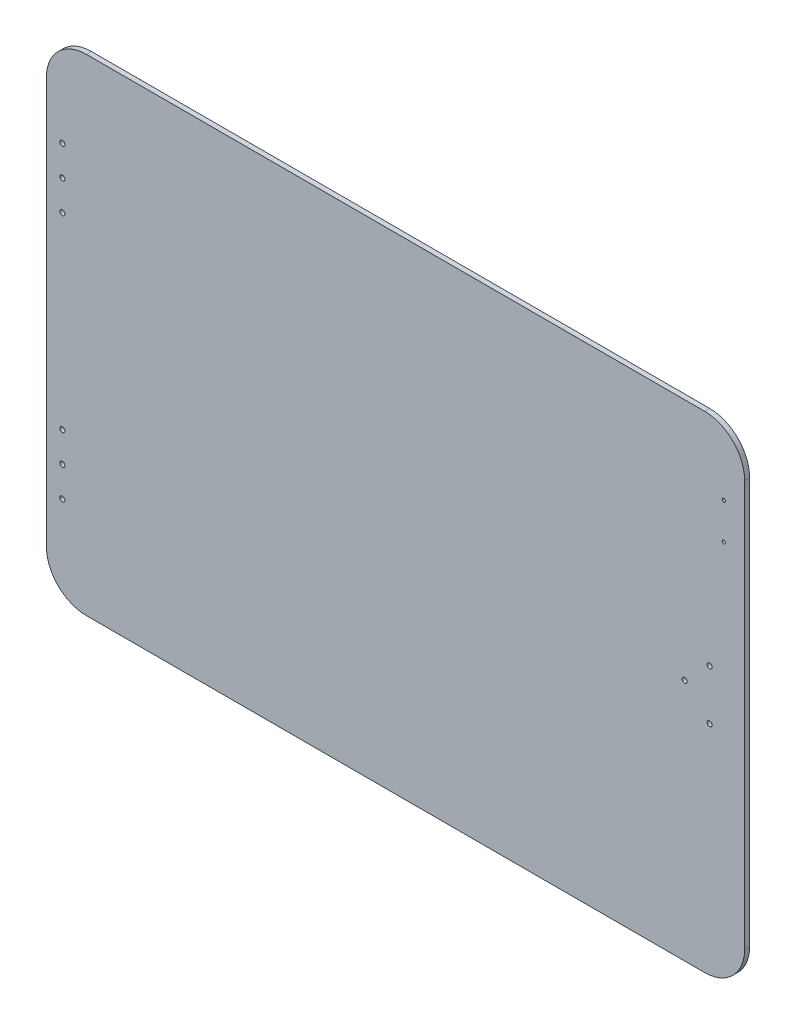
ISO-10303-21;
HEADER;
FILE_DESCRIPTION(('STEP AP214'),'2;1');
FILE_NAME('part.step','',(''),(''),'','','');
FILE_SCHEMA(('AUTOMOTIVE_DESIGN { 1 0 10303 214 1 1 1 1 }'));
ENDSEC;
DATA;
#1=APPLICATION_CONTEXT('core data for automotive mechanical design processes');
#2=APPLICATION_PROTOCOL_DEFINITION('international standard','automotive_design',2000,#1);
#3=PRODUCT_CONTEXT('',#1,'mechanical');
#4=PRODUCT('Part','Part','',(#3));
#5=PRODUCT_RELATED_PRODUCT_CATEGORY('part','',(#4));
#6=PRODUCT_DEFINITION_FORMATION('','',#4);
#7=PRODUCT_DEFINITION_CONTEXT('part definition',#1,'design');
#8=PRODUCT_DEFINITION('design','',#6,#7);
#9=PRODUCT_DEFINITION_SHAPE('','',#8);
#10=(LENGTH_UNIT() NAMED_UNIT(*) SI_UNIT(.MILLI.,.METRE.));
#11=(NAMED_UNIT(*) PLANE_ANGLE_UNIT() SI_UNIT($,.RADIAN.));
#12=(NAMED_UNIT(*) SI_UNIT($,.STERADIAN.) SOLID_ANGLE_UNIT());
#13=UNCERTAINTY_MEASURE_WITH_UNIT(LENGTH_MEASURE(1.E-05),#10,'distance_accuracy_value','');
#14=(GEOMETRIC_REPRESENTATION_CONTEXT(3) GLOBAL_UNCERTAINTY_ASSIGNED_CONTEXT((#13)) GLOBAL_UNIT_ASSIGNED_CONTEXT((#10,
#11,#12)) REPRESENTATION_CONTEXT('',''));
#15=CARTESIAN_POINT('',(0.,0.,0.));
#16=DIRECTION('',(0.,0.,1.));
#17=DIRECTION('',(1.,0.,0.));
#18=AXIS2_PLACEMENT_3D('',#15,#16,#17);
#19=CARTESIAN_POINT('',(-349.,-242.95,5.));
#20=DIRECTION('',(1.,0.,0.));
#21=DIRECTION('',(0.,0.,-1.));
#22=AXIS2_PLACEMENT_3D('',#19,#20,#21);
#23=PLANE('',#22);
#24=DIRECTION('',(0.,-1.,0.));
#25=VECTOR('',#24,1.);
#26=CARTESIAN_POINT('',(-349.,-242.95,5.));
#27=LINE('',#26,#25);
#28=CARTESIAN_POINT('',(-349.,202.95,5.));
#29=VERTEX_POINT('',#28);
#30=CARTESIAN_POINT('',(-349.,-202.95,5.));
#31=VERTEX_POINT('',#30);
#32=EDGE_CURVE('E129',#29,#31,#27,.T.);
#33=ORIENTED_EDGE('',*,*,#32,.F.);
#34=DIRECTION('',(0.,0.,-1.));
#35=VECTOR('',#34,1.);
#36=CARTESIAN_POINT('',(-349.,202.95,5.));
#37=LINE('',#36,#35);
#38=CARTESIAN_POINT('',(-349.,202.95,0.));
#39=VERTEX_POINT('',#38);
#40=EDGE_CURVE('E113',#29,#39,#37,.T.);
#41=ORIENTED_EDGE('',*,*,#40,.T.);
#42=DIRECTION('',(0.,-1.,0.));
#43=VECTOR('',#42,1.);
#44=CARTESIAN_POINT('',(-349.,-242.95,0.));
#45=LINE('',#44,#43);
#46=CARTESIAN_POINT('',(-349.,-202.95,0.));
#47=VERTEX_POINT('',#46);
#48=EDGE_CURVE('E126',#39,#47,#45,.T.);
#49=ORIENTED_EDGE('',*,*,#48,.T.);
#50=DIRECTION('',(0.,0.,-1.));
#51=VECTOR('',#50,1.);
#52=CARTESIAN_POINT('',(-349.,-202.95,5.));
#53=LINE('',#52,#51);
#54=EDGE_CURVE('E132',#47,#31,#53,.F.);
#55=ORIENTED_EDGE('',*,*,#54,.T.);
#56=EDGE_LOOP('',(#33,#41,#49,#55));
#57=FACE_BOUND('',#56,.T.);
#58=ADVANCED_FACE('F42',(#57),#23,.F.);
#59=CARTESIAN_POINT('',(349.,-242.95,5.));
#60=DIRECTION('',(0.,1.,0.));
#61=DIRECTION('',(0.,0.,1.));
#62=AXIS2_PLACEMENT_3D('',#59,#60,#61);
#63=PLANE('',#62);
#64=DIRECTION('',(1.,0.,0.));
#65=VECTOR('',#64,1.);
#66=CARTESIAN_POINT('',(349.,-242.95,5.));
#67=LINE('',#66,#65);
#68=CARTESIAN_POINT('',(-309.000000000001,-242.95,5.));
#69=VERTEX_POINT('',#68);
#70=CARTESIAN_POINT('',(309.,-242.95,5.));
#71=VERTEX_POINT('',#70);
#72=EDGE_CURVE('E267',#69,#71,#67,.T.);
#73=ORIENTED_EDGE('',*,*,#72,.F.);
#74=DIRECTION('',(0.,0.,-1.));
#75=VECTOR('',#74,1.);
#76=CARTESIAN_POINT('',(-309.000000000001,-242.95,5.));
#77=LINE('',#76,#75);
#78=CARTESIAN_POINT('',(-309.000000000001,-242.95,0.));
#79=VERTEX_POINT('',#78);
#80=EDGE_CURVE('E186',#69,#79,#77,.T.);
#81=ORIENTED_EDGE('',*,*,#80,.T.);
#82=DIRECTION('',(1.,0.,0.));
#83=VECTOR('',#82,1.);
#84=CARTESIAN_POINT('',(349.,-242.95,0.));
#85=LINE('',#84,#83);
#86=CARTESIAN_POINT('',(309.,-242.95,0.));
#87=VERTEX_POINT('',#86);
#88=EDGE_CURVE('E137',#79,#87,#85,.T.);
#89=ORIENTED_EDGE('',*,*,#88,.T.);
#90=DIRECTION('',(0.,0.,-1.));
#91=VECTOR('',#90,1.);
#92=CARTESIAN_POINT('',(309.,-242.95,5.));
#93=LINE('',#92,#91);
#94=EDGE_CURVE('E183',#87,#71,#93,.F.);
#95=ORIENTED_EDGE('',*,*,#94,.T.);
#96=EDGE_LOOP('',(#73,#81,#89,#95));
#97=FACE_BOUND('',#96,.T.);
#98=ADVANCED_FACE('F285',(#97),#63,.F.);
#99=CARTESIAN_POINT('',(349.,-242.95,5.));
#100=DIRECTION('',(-1.,0.,0.));
#101=DIRECTION('',(0.,0.,1.));
#102=AXIS2_PLACEMENT_3D('',#99,#100,#101);
#103=PLANE('',#102);
#104=DIRECTION('',(0.,1.,0.));
#105=VECTOR('',#104,1.);
#106=CARTESIAN_POINT('',(349.,-242.95,5.));
#107=LINE('',#106,#105);
#108=CARTESIAN_POINT('',(349.,-202.95,5.));
#109=VERTEX_POINT('',#108);
#110=CARTESIAN_POINT('',(349.,202.95,5.));
#111=VERTEX_POINT('',#110);
#112=EDGE_CURVE('E219',#109,#111,#107,.T.);
#113=ORIENTED_EDGE('',*,*,#112,.F.);
#114=DIRECTION('',(0.,0.,-1.));
#115=VECTOR('',#114,1.);
#116=CARTESIAN_POINT('',(349.,-202.95,5.));
#117=LINE('',#116,#115);
#118=CARTESIAN_POINT('',(349.,-202.95,0.));
#119=VERTEX_POINT('',#118);
#120=EDGE_CURVE('E11',#109,#119,#117,.T.);
#121=ORIENTED_EDGE('',*,*,#120,.T.);
#122=DIRECTION('',(0.,1.,0.));
#123=VECTOR('',#122,1.);
#124=CARTESIAN_POINT('',(349.,-242.95,0.));
#125=LINE('',#124,#123);
#126=CARTESIAN_POINT('',(349.,202.95,0.));
#127=VERTEX_POINT('',#126);
#128=EDGE_CURVE('E144',#119,#127,#125,.T.);
#129=ORIENTED_EDGE('',*,*,#128,.T.);
#130=DIRECTION('',(0.,0.,-1.));
#131=VECTOR('',#130,1.);
#132=CARTESIAN_POINT('',(349.,202.95,5.));
#133=LINE('',#132,#131);
#134=EDGE_CURVE('E51',#127,#111,#133,.F.);
#135=ORIENTED_EDGE('',*,*,#134,.T.);
#136=EDGE_LOOP('',(#113,#121,#129,#135));
#137=FACE_BOUND('',#136,.T.);
#138=ADVANCED_FACE('F279',(#137),#103,.F.);
#139=CARTESIAN_POINT('',(349.,242.95,5.));
#140=DIRECTION('',(0.,-1.,0.));
#141=DIRECTION('',(0.,0.,-1.));
#142=AXIS2_PLACEMENT_3D('',#139,#140,#141);
#143=PLANE('',#142);
#144=DIRECTION('',(-1.,0.,0.));
#145=VECTOR('',#144,1.);
#146=CARTESIAN_POINT('',(349.,242.95,0.));
#147=LINE('',#146,#145);
#148=CARTESIAN_POINT('',(309.,242.95,0.));
#149=VERTEX_POINT('',#148);
#150=CARTESIAN_POINT('',(-309.000000000001,242.95,0.));
#151=VERTEX_POINT('',#150);
#152=EDGE_CURVE('E155',#149,#151,#147,.T.);
#153=ORIENTED_EDGE('',*,*,#152,.T.);
#154=DIRECTION('',(0.,0.,-1.));
#155=VECTOR('',#154,1.);
#156=CARTESIAN_POINT('',(-309.000000000001,242.95,5.));
#157=LINE('',#156,#155);
#158=CARTESIAN_POINT('',(-309.000000000001,242.95,5.));
#159=VERTEX_POINT('',#158);
#160=EDGE_CURVE('E114',#151,#159,#157,.F.);
#161=ORIENTED_EDGE('',*,*,#160,.T.);
#162=DIRECTION('',(-1.,0.,0.));
#163=VECTOR('',#162,1.);
#164=CARTESIAN_POINT('',(349.,242.95,5.));
#165=LINE('',#164,#163);
#166=CARTESIAN_POINT('',(309.,242.95,5.));
#167=VERTEX_POINT('',#166);
#168=EDGE_CURVE('E151',#167,#159,#165,.T.);
#169=ORIENTED_EDGE('',*,*,#168,.F.);
#170=DIRECTION('',(0.,0.,-1.));
#171=VECTOR('',#170,1.);
#172=CARTESIAN_POINT('',(309.,242.95,5.));
#173=LINE('',#172,#171);
#174=EDGE_CURVE('E120',#167,#149,#173,.T.);
#175=ORIENTED_EDGE('',*,*,#174,.T.);
#176=EDGE_LOOP('',(#153,#161,#169,#175));
#177=FACE_BOUND('',#176,.T.);
#178=ADVANCED_FACE('F277',(#177),#143,.F.);
#179=CARTESIAN_POINT('',(0.,0.,5.));
#180=DIRECTION('',(0.,0.,1.));
#181=DIRECTION('',(1.,0.,0.));
#182=AXIS2_PLACEMENT_3D('',#179,#180,#181);
#183=PLANE('',#182);
#184=CARTESIAN_POINT('',(328.180642757211,175.458967427581,5.));
#185=DIRECTION('',(0.,0.,1.));
#186=DIRECTION('',(1.,0.,0.));
#187=AXIS2_PLACEMENT_3D('',#184,#185,#186);
#188=CIRCLE('',#187,1.64999999999998);
#189=CARTESIAN_POINT('',(329.830642757211,175.458967427581,5.));
#190=VERTEX_POINT('',#189);
#191=EDGE_CURVE('E197',#190,#190,#188,.T.);
#192=ORIENTED_EDGE('',*,*,#191,.F.);
#193=EDGE_LOOP('',(#192));
#194=FACE_BOUND('',#193,.T.);
#195=CARTESIAN_POINT('',(328.180642757211,139.458967427581,5.));
#196=DIRECTION('',(0.,0.,1.));
#197=DIRECTION('',(1.,0.,0.));
#198=AXIS2_PLACEMENT_3D('',#195,#196,#197);
#199=CIRCLE('',#198,1.64999999999998);
#200=CARTESIAN_POINT('',(329.830642757211,139.458967427581,5.));
#201=VERTEX_POINT('',#200);
#202=EDGE_CURVE('E367',#201,#201,#199,.T.);
#203=ORIENTED_EDGE('',*,*,#202,.F.);
#204=EDGE_LOOP('',(#203));
#205=FACE_BOUND('',#204,.T.);
#206=CARTESIAN_POINT('',(-333.,-153.95,5.));
#207=DIRECTION('',(0.,0.,1.));
#208=DIRECTION('',(1.,0.,0.));
#209=AXIS2_PLACEMENT_3D('',#206,#207,#208);
#210=CIRCLE('',#209,2.5);
#211=CARTESIAN_POINT('',(-330.5,-153.95,5.));
#212=VERTEX_POINT('',#211);
#213=EDGE_CURVE('E237',#212,#212,#210,.T.);
#214=ORIENTED_EDGE('',*,*,#213,.F.);
#215=EDGE_LOOP('',(#214));
#216=FACE_BOUND('',#215,.T.);
#217=CARTESIAN_POINT('',(-333.,-123.95,5.));
#218=DIRECTION('',(0.,0.,1.));
#219=DIRECTION('',(1.,0.,0.));
#220=AXIS2_PLACEMENT_3D('',#217,#218,#219);
#221=CIRCLE('',#220,2.5);
#222=CARTESIAN_POINT('',(-330.5,-123.95,5.));
#223=VERTEX_POINT('',#222);
#224=EDGE_CURVE('E225',#223,#223,#221,.T.);
#225=ORIENTED_EDGE('',*,*,#224,.F.);
#226=EDGE_LOOP('',(#225));
#227=FACE_BOUND('',#226,.T.);
#228=CARTESIAN_POINT('',(-333.,-93.9499999999999,5.));
#229=DIRECTION('',(0.,0.,1.));
#230=DIRECTION('',(1.,0.,0.));
#231=AXIS2_PLACEMENT_3D('',#228,#229,#230);
#232=CIRCLE('',#231,2.5);
#233=CARTESIAN_POINT('',(-330.5,-93.9499999999999,5.));
#234=VERTEX_POINT('',#233);
#235=EDGE_CURVE('E205',#234,#234,#232,.T.);
#236=ORIENTED_EDGE('',*,*,#235,.F.);
#237=EDGE_LOOP('',(#236));
#238=FACE_BOUND('',#237,.T.);
#239=CARTESIAN_POINT('',(314.000000000001,25.,5.));
#240=DIRECTION('',(0.,0.,1.));
#241=DIRECTION('',(1.,0.,0.));
#242=AXIS2_PLACEMENT_3D('',#239,#240,#241);
#243=CIRCLE('',#242,2.5);
#244=CARTESIAN_POINT('',(316.500000000001,25.,5.));
#245=VERTEX_POINT('',#244);
#246=EDGE_CURVE('E204',#245,#245,#243,.T.);
#247=ORIENTED_EDGE('',*,*,#246,.F.);
#248=EDGE_LOOP('',(#247));
#249=FACE_BOUND('',#248,.T.);
#250=CARTESIAN_POINT('',(289.,0.,5.));
#251=DIRECTION('',(0.,0.,1.));
#252=DIRECTION('',(1.,0.,0.));
#253=AXIS2_PLACEMENT_3D('',#250,#251,#252);
#254=CIRCLE('',#253,2.5);
#255=CARTESIAN_POINT('',(291.5,0.,5.));
#256=VERTEX_POINT('',#255);
#257=EDGE_CURVE('E195',#256,#256,#254,.T.);
#258=ORIENTED_EDGE('',*,*,#257,.F.);
#259=EDGE_LOOP('',(#258));
#260=FACE_BOUND('',#259,.T.);
#261=CARTESIAN_POINT('',(314.,-25.,5.));
#262=DIRECTION('',(0.,0.,1.));
#263=DIRECTION('',(1.,0.,0.));
#264=AXIS2_PLACEMENT_3D('',#261,#262,#263);
#265=CIRCLE('',#264,2.5);
#266=CARTESIAN_POINT('',(316.5,-25.,5.));
#267=VERTEX_POINT('',#266);
#268=EDGE_CURVE('E194',#267,#267,#265,.T.);
#269=ORIENTED_EDGE('',*,*,#268,.F.);
#270=EDGE_LOOP('',(#269));
#271=FACE_BOUND('',#270,.T.);
#272=CARTESIAN_POINT('',(-333.,153.95,5.));
#273=DIRECTION('',(0.,0.,1.));
#274=DIRECTION('',(1.,0.,0.));
#275=AXIS2_PLACEMENT_3D('',#272,#273,#274);
#276=CIRCLE('',#275,2.5);
#277=CARTESIAN_POINT('',(-330.5,153.95,5.));
#278=VERTEX_POINT('',#277);
#279=EDGE_CURVE('E216',#278,#278,#276,.T.);
#280=ORIENTED_EDGE('',*,*,#279,.F.);
#281=EDGE_LOOP('',(#280));
#282=FACE_BOUND('',#281,.T.);
#283=CARTESIAN_POINT('',(-333.,123.95,5.));
#284=DIRECTION('',(0.,0.,1.));
#285=DIRECTION('',(1.,0.,0.));
#286=AXIS2_PLACEMENT_3D('',#283,#284,#285);
#287=CIRCLE('',#286,2.5);
#288=CARTESIAN_POINT('',(-330.5,123.95,5.));
#289=VERTEX_POINT('',#288);
#290=EDGE_CURVE('E215',#289,#289,#287,.T.);
#291=ORIENTED_EDGE('',*,*,#290,.F.);
#292=EDGE_LOOP('',(#291));
#293=FACE_BOUND('',#292,.T.);
#294=CARTESIAN_POINT('',(-333.,93.95,5.));
#295=DIRECTION('',(0.,0.,1.));
#296=DIRECTION('',(1.,0.,0.));
#297=AXIS2_PLACEMENT_3D('',#294,#295,#296);
#298=CIRCLE('',#297,2.5);
#299=CARTESIAN_POINT('',(-330.5,93.95,5.));
#300=VERTEX_POINT('',#299);
#301=EDGE_CURVE('E148',#300,#300,#298,.T.);
#302=ORIENTED_EDGE('',*,*,#301,.F.);
#303=EDGE_LOOP('',(#302));
#304=FACE_BOUND('',#303,.T.);
#305=ORIENTED_EDGE('',*,*,#168,.T.);
#306=CARTESIAN_POINT('',(-309.000000000001,202.95,5.));
#307=DIRECTION('',(0.,0.,1.));
#308=DIRECTION('',(1.,0.,0.));
#309=AXIS2_PLACEMENT_3D('',#306,#307,#308);
#310=CIRCLE('',#309,40.);
#311=EDGE_CURVE('E180',#159,#29,#310,.T.);
#312=ORIENTED_EDGE('',*,*,#311,.T.);
#313=ORIENTED_EDGE('',*,*,#32,.T.);
#314=CARTESIAN_POINT('',(-309.000000000001,-202.95,5.));
#315=DIRECTION('',(0.,0.,1.));
#316=DIRECTION('',(1.,0.,0.));
#317=AXIS2_PLACEMENT_3D('',#314,#315,#316);
#318=CIRCLE('',#317,40.);
#319=EDGE_CURVE('E177',#31,#69,#318,.T.);
#320=ORIENTED_EDGE('',*,*,#319,.T.);
#321=ORIENTED_EDGE('',*,*,#72,.T.);
#322=CARTESIAN_POINT('',(309.,-202.95,5.));
#323=DIRECTION('',(0.,0.,1.));
#324=DIRECTION('',(1.,0.,0.));
#325=AXIS2_PLACEMENT_3D('',#322,#323,#324);
#326=CIRCLE('',#325,40.);
#327=EDGE_CURVE('E64',#71,#109,#326,.T.);
#328=ORIENTED_EDGE('',*,*,#327,.T.);
#329=ORIENTED_EDGE('',*,*,#112,.T.);
#330=CARTESIAN_POINT('',(309.,202.95,5.));
#331=DIRECTION('',(0.,0.,1.));
#332=DIRECTION('',(1.,0.,0.));
#333=AXIS2_PLACEMENT_3D('',#330,#331,#332);
#334=CIRCLE('',#333,40.);
#335=EDGE_CURVE('E172',#111,#167,#334,.T.);
#336=ORIENTED_EDGE('',*,*,#335,.T.);
#337=EDGE_LOOP('',(#305,#312,#313,#320,#321,#328,#329,#336));
#338=FACE_BOUND('',#337,.T.);
#339=ADVANCED_FACE('F271',(#194,#205,#216,#227,#238,#249,#260,#271,#282,#293,#304,#338),#183,.T.);
#340=CARTESIAN_POINT('',(0.,0.,0.));
#341=DIRECTION('',(0.,0.,1.));
#342=DIRECTION('',(1.,0.,0.));
#343=AXIS2_PLACEMENT_3D('',#340,#341,#342);
#344=PLANE('',#343);
#345=CARTESIAN_POINT('',(328.180642757211,175.458967427581,0.));
#346=DIRECTION('',(0.,0.,1.));
#347=DIRECTION('',(1.,0.,0.));
#348=AXIS2_PLACEMENT_3D('',#345,#346,#347);
#349=CIRCLE('',#348,1.64999999999998);
#350=CARTESIAN_POINT('',(329.830642757211,175.458967427581,0.));
#351=VERTEX_POINT('',#350);
#352=EDGE_CURVE('E200',#351,#351,#349,.T.);
#353=ORIENTED_EDGE('',*,*,#352,.T.);
#354=EDGE_LOOP('',(#353));
#355=FACE_BOUND('',#354,.T.);
#356=CARTESIAN_POINT('',(328.180642757211,139.458967427581,0.));
#357=DIRECTION('',(0.,0.,1.));
#358=DIRECTION('',(1.,0.,0.));
#359=AXIS2_PLACEMENT_3D('',#356,#357,#358);
#360=CIRCLE('',#359,1.64999999999998);
#361=CARTESIAN_POINT('',(329.830642757211,139.458967427581,0.));
#362=VERTEX_POINT('',#361);
#363=EDGE_CURVE('E394',#362,#362,#360,.T.);
#364=ORIENTED_EDGE('',*,*,#363,.T.);
#365=EDGE_LOOP('',(#364));
#366=FACE_BOUND('',#365,.T.);
#367=CARTESIAN_POINT('',(-333.,-153.95,0.));
#368=DIRECTION('',(0.,0.,1.));
#369=DIRECTION('',(1.,0.,0.));
#370=AXIS2_PLACEMENT_3D('',#367,#368,#369);
#371=CIRCLE('',#370,2.5);
#372=CARTESIAN_POINT('',(-330.5,-153.95,0.));
#373=VERTEX_POINT('',#372);
#374=EDGE_CURVE('E228',#373,#373,#371,.T.);
#375=ORIENTED_EDGE('',*,*,#374,.T.);
#376=EDGE_LOOP('',(#375));
#377=FACE_BOUND('',#376,.T.);
#378=CARTESIAN_POINT('',(-333.,-123.95,0.));
#379=DIRECTION('',(0.,0.,1.));
#380=DIRECTION('',(1.,0.,0.));
#381=AXIS2_PLACEMENT_3D('',#378,#379,#380);
#382=CIRCLE('',#381,2.5);
#383=CARTESIAN_POINT('',(-330.5,-123.95,0.));
#384=VERTEX_POINT('',#383);
#385=EDGE_CURVE('E227',#384,#384,#382,.T.);
#386=ORIENTED_EDGE('',*,*,#385,.T.);
#387=EDGE_LOOP('',(#386));
#388=FACE_BOUND('',#387,.T.);
#389=CARTESIAN_POINT('',(-333.,-93.9499999999999,0.));
#390=DIRECTION('',(0.,0.,1.));
#391=DIRECTION('',(1.,0.,0.));
#392=AXIS2_PLACEMENT_3D('',#389,#390,#391);
#393=CIRCLE('',#392,2.5);
#394=CARTESIAN_POINT('',(-330.5,-93.9499999999999,0.));
#395=VERTEX_POINT('',#394);
#396=EDGE_CURVE('E202',#395,#395,#393,.T.);
#397=ORIENTED_EDGE('',*,*,#396,.T.);
#398=EDGE_LOOP('',(#397));
#399=FACE_BOUND('',#398,.T.);
#400=CARTESIAN_POINT('',(314.000000000001,25.,0.));
#401=DIRECTION('',(0.,0.,1.));
#402=DIRECTION('',(1.,0.,0.));
#403=AXIS2_PLACEMENT_3D('',#400,#401,#402);
#404=CIRCLE('',#403,2.5);
#405=CARTESIAN_POINT('',(316.500000000001,25.,0.));
#406=VERTEX_POINT('',#405);
#407=EDGE_CURVE('E247',#406,#406,#404,.T.);
#408=ORIENTED_EDGE('',*,*,#407,.T.);
#409=EDGE_LOOP('',(#408));
#410=FACE_BOUND('',#409,.T.);
#411=CARTESIAN_POINT('',(289.,0.,0.));
#412=DIRECTION('',(0.,0.,1.));
#413=DIRECTION('',(1.,0.,0.));
#414=AXIS2_PLACEMENT_3D('',#411,#412,#413);
#415=CIRCLE('',#414,2.5);
#416=CARTESIAN_POINT('',(291.5,0.,0.));
#417=VERTEX_POINT('',#416);
#418=EDGE_CURVE('E191',#417,#417,#415,.T.);
#419=ORIENTED_EDGE('',*,*,#418,.T.);
#420=EDGE_LOOP('',(#419));
#421=FACE_BOUND('',#420,.T.);
#422=CARTESIAN_POINT('',(314.,-25.,0.));
#423=DIRECTION('',(0.,0.,1.));
#424=DIRECTION('',(1.,0.,0.));
#425=AXIS2_PLACEMENT_3D('',#422,#423,#424);
#426=CIRCLE('',#425,2.5);
#427=CARTESIAN_POINT('',(316.5,-25.,0.));
#428=VERTEX_POINT('',#427);
#429=EDGE_CURVE('E222',#428,#428,#426,.T.);
#430=ORIENTED_EDGE('',*,*,#429,.T.);
#431=EDGE_LOOP('',(#430));
#432=FACE_BOUND('',#431,.T.);
#433=CARTESIAN_POINT('',(-333.,153.95,0.));
#434=DIRECTION('',(0.,0.,1.));
#435=DIRECTION('',(1.,0.,0.));
#436=AXIS2_PLACEMENT_3D('',#433,#434,#435);
#437=CIRCLE('',#436,2.5);
#438=CARTESIAN_POINT('',(-330.5,153.95,0.));
#439=VERTEX_POINT('',#438);
#440=EDGE_CURVE('E212',#439,#439,#437,.T.);
#441=ORIENTED_EDGE('',*,*,#440,.T.);
#442=EDGE_LOOP('',(#441));
#443=FACE_BOUND('',#442,.T.);
#444=CARTESIAN_POINT('',(-333.,123.95,0.));
#445=DIRECTION('',(0.,0.,1.));
#446=DIRECTION('',(1.,0.,0.));
#447=AXIS2_PLACEMENT_3D('',#444,#445,#446);
#448=CIRCLE('',#447,2.5);
#449=CARTESIAN_POINT('',(-330.5,123.95,0.));
#450=VERTEX_POINT('',#449);
#451=EDGE_CURVE('E209',#450,#450,#448,.T.);
#452=ORIENTED_EDGE('',*,*,#451,.T.);
#453=EDGE_LOOP('',(#452));
#454=FACE_BOUND('',#453,.T.);
#455=CARTESIAN_POINT('',(-333.,93.95,0.));
#456=DIRECTION('',(0.,0.,1.));
#457=DIRECTION('',(1.,0.,0.));
#458=AXIS2_PLACEMENT_3D('',#455,#456,#457);
#459=CIRCLE('',#458,2.5);
#460=CARTESIAN_POINT('',(-330.5,93.95,0.));
#461=VERTEX_POINT('',#460);
#462=EDGE_CURVE('E138',#461,#461,#459,.T.);
#463=ORIENTED_EDGE('',*,*,#462,.T.);
#464=EDGE_LOOP('',(#463));
#465=FACE_BOUND('',#464,.T.);
#466=ORIENTED_EDGE('',*,*,#48,.F.);
#467=CARTESIAN_POINT('',(-309.000000000001,202.95,0.));
#468=DIRECTION('',(0.,0.,1.));
#469=DIRECTION('',(1.,0.,0.));
#470=AXIS2_PLACEMENT_3D('',#467,#468,#469);
#471=CIRCLE('',#470,40.);
#472=EDGE_CURVE('E109',#39,#151,#471,.F.);
#473=ORIENTED_EDGE('',*,*,#472,.T.);
#474=ORIENTED_EDGE('',*,*,#152,.F.);
#475=CARTESIAN_POINT('',(309.,202.95,0.));
#476=DIRECTION('',(0.,0.,1.));
#477=DIRECTION('',(1.,0.,0.));
#478=AXIS2_PLACEMENT_3D('',#475,#476,#477);
#479=CIRCLE('',#478,40.);
#480=EDGE_CURVE('E131',#149,#127,#479,.F.);
#481=ORIENTED_EDGE('',*,*,#480,.T.);
#482=ORIENTED_EDGE('',*,*,#128,.F.);
#483=CARTESIAN_POINT('',(309.,-202.95,0.));
#484=DIRECTION('',(0.,0.,1.));
#485=DIRECTION('',(1.,0.,0.));
#486=AXIS2_PLACEMENT_3D('',#483,#484,#485);
#487=CIRCLE('',#486,40.);
#488=EDGE_CURVE('E162',#119,#87,#487,.F.);
#489=ORIENTED_EDGE('',*,*,#488,.T.);
#490=ORIENTED_EDGE('',*,*,#88,.F.);
#491=CARTESIAN_POINT('',(-309.000000000001,-202.95,0.));
#492=DIRECTION('',(0.,0.,1.));
#493=DIRECTION('',(1.,0.,0.));
#494=AXIS2_PLACEMENT_3D('',#491,#492,#493);
#495=CIRCLE('',#494,40.);
#496=EDGE_CURVE('E121',#79,#47,#495,.F.);
#497=ORIENTED_EDGE('',*,*,#496,.T.);
#498=EDGE_LOOP('',(#466,#473,#474,#481,#482,#489,#490,#497));
#499=FACE_BOUND('',#498,.T.);
#500=ADVANCED_FACE('F134',(#355,#366,#377,#388,#399,#410,#421,#432,#443,#454,#465,#499),#344,.F.);
#501=CARTESIAN_POINT('',(-309.000000000001,202.95,5.));
#502=DIRECTION('',(0.,0.,-1.));
#503=DIRECTION('',(-1.,0.,0.));
#504=AXIS2_PLACEMENT_3D('',#501,#502,#503);
#505=CYLINDRICAL_SURFACE('',#504,40.);
#506=ORIENTED_EDGE('',*,*,#311,.F.);
#507=ORIENTED_EDGE('',*,*,#160,.F.);
#508=ORIENTED_EDGE('',*,*,#472,.F.);
#509=ORIENTED_EDGE('',*,*,#40,.F.);
#510=EDGE_LOOP('',(#506,#507,#508,#509));
#511=FACE_BOUND('',#510,.T.);
#512=ADVANCED_FACE('F112',(#511),#505,.T.);
#513=CARTESIAN_POINT('',(-309.000000000001,-202.95,5.));
#514=DIRECTION('',(0.,0.,-1.));
#515=DIRECTION('',(-1.,0.,0.));
#516=AXIS2_PLACEMENT_3D('',#513,#514,#515);
#517=CYLINDRICAL_SURFACE('',#516,40.);
#518=ORIENTED_EDGE('',*,*,#319,.F.);
#519=ORIENTED_EDGE('',*,*,#54,.F.);
#520=ORIENTED_EDGE('',*,*,#496,.F.);
#521=ORIENTED_EDGE('',*,*,#80,.F.);
#522=EDGE_LOOP('',(#518,#519,#520,#521));
#523=FACE_BOUND('',#522,.T.);
#524=ADVANCED_FACE('F289',(#523),#517,.T.);
#525=CARTESIAN_POINT('',(309.,-202.95,5.));
#526=DIRECTION('',(0.,0.,-1.));
#527=DIRECTION('',(-1.,0.,0.));
#528=AXIS2_PLACEMENT_3D('',#525,#526,#527);
#529=CYLINDRICAL_SURFACE('',#528,40.);
#530=ORIENTED_EDGE('',*,*,#327,.F.);
#531=ORIENTED_EDGE('',*,*,#94,.F.);
#532=ORIENTED_EDGE('',*,*,#488,.F.);
#533=ORIENTED_EDGE('',*,*,#120,.F.);
#534=EDGE_LOOP('',(#530,#531,#532,#533));
#535=FACE_BOUND('',#534,.T.);
#536=ADVANCED_FACE('F281',(#535),#529,.T.);
#537=CARTESIAN_POINT('',(309.,202.95,5.));
#538=DIRECTION('',(0.,0.,-1.));
#539=DIRECTION('',(-1.,0.,0.));
#540=AXIS2_PLACEMENT_3D('',#537,#538,#539);
#541=CYLINDRICAL_SURFACE('',#540,40.);
#542=ORIENTED_EDGE('',*,*,#335,.F.);
#543=ORIENTED_EDGE('',*,*,#134,.F.);
#544=ORIENTED_EDGE('',*,*,#480,.F.);
#545=ORIENTED_EDGE('',*,*,#174,.F.);
#546=EDGE_LOOP('',(#542,#543,#544,#545));
#547=FACE_BOUND('',#546,.T.);
#548=ADVANCED_FACE('F44',(#547),#541,.T.);
#549=CARTESIAN_POINT('',(-333.,93.95,5.));
#550=DIRECTION('',(0.,0.,1.));
#551=DIRECTION('',(1.,0.,0.));
#552=AXIS2_PLACEMENT_3D('',#549,#550,#551);
#553=CYLINDRICAL_SURFACE('',#552,2.5);
#554=ORIENTED_EDGE('',*,*,#462,.F.);
#555=EDGE_LOOP('',(#554));
#556=FACE_BOUND('',#555,.T.);
#557=ORIENTED_EDGE('',*,*,#301,.T.);
#558=EDGE_LOOP('',(#557));
#559=FACE_BOUND('',#558,.T.);
#560=ADVANCED_FACE('F314',(#556,#559),#553,.F.);
#561=CARTESIAN_POINT('',(-333.,123.95,5.));
#562=DIRECTION('',(0.,0.,1.));
#563=DIRECTION('',(1.,0.,0.));
#564=AXIS2_PLACEMENT_3D('',#561,#562,#563);
#565=CYLINDRICAL_SURFACE('',#564,2.5);
#566=ORIENTED_EDGE('',*,*,#451,.F.);
#567=EDGE_LOOP('',(#566));
#568=FACE_BOUND('',#567,.T.);
#569=ORIENTED_EDGE('',*,*,#290,.T.);
#570=EDGE_LOOP('',(#569));
#571=FACE_BOUND('',#570,.T.);
#572=ADVANCED_FACE('F317',(#568,#571),#565,.F.);
#573=CARTESIAN_POINT('',(-333.,153.95,5.));
#574=DIRECTION('',(0.,0.,1.));
#575=DIRECTION('',(1.,0.,0.));
#576=AXIS2_PLACEMENT_3D('',#573,#574,#575);
#577=CYLINDRICAL_SURFACE('',#576,2.5);
#578=ORIENTED_EDGE('',*,*,#440,.F.);
#579=EDGE_LOOP('',(#578));
#580=FACE_BOUND('',#579,.T.);
#581=ORIENTED_EDGE('',*,*,#279,.T.);
#582=EDGE_LOOP('',(#581));
#583=FACE_BOUND('',#582,.T.);
#584=ADVANCED_FACE('F321',(#580,#583),#577,.F.);
#585=CARTESIAN_POINT('',(314.,-25.,5.));
#586=DIRECTION('',(0.,0.,1.));
#587=DIRECTION('',(1.,0.,0.));
#588=AXIS2_PLACEMENT_3D('',#585,#586,#587);
#589=CYLINDRICAL_SURFACE('',#588,2.5);
#590=ORIENTED_EDGE('',*,*,#429,.F.);
#591=EDGE_LOOP('',(#590));
#592=FACE_BOUND('',#591,.T.);
#593=ORIENTED_EDGE('',*,*,#268,.T.);
#594=EDGE_LOOP('',(#593));
#595=FACE_BOUND('',#594,.T.);
#596=ADVANCED_FACE('F325',(#592,#595),#589,.F.);
#597=CARTESIAN_POINT('',(289.,0.,5.));
#598=DIRECTION('',(0.,0.,1.));
#599=DIRECTION('',(1.,0.,0.));
#600=AXIS2_PLACEMENT_3D('',#597,#598,#599);
#601=CYLINDRICAL_SURFACE('',#600,2.5);
#602=ORIENTED_EDGE('',*,*,#418,.F.);
#603=EDGE_LOOP('',(#602));
#604=FACE_BOUND('',#603,.T.);
#605=ORIENTED_EDGE('',*,*,#257,.T.);
#606=EDGE_LOOP('',(#605));
#607=FACE_BOUND('',#606,.T.);
#608=ADVANCED_FACE('F329',(#604,#607),#601,.F.);
#609=CARTESIAN_POINT('',(314.000000000001,25.,5.));
#610=DIRECTION('',(0.,0.,1.));
#611=DIRECTION('',(1.,0.,0.));
#612=AXIS2_PLACEMENT_3D('',#609,#610,#611);
#613=CYLINDRICAL_SURFACE('',#612,2.5);
#614=ORIENTED_EDGE('',*,*,#407,.F.);
#615=EDGE_LOOP('',(#614));
#616=FACE_BOUND('',#615,.T.);
#617=ORIENTED_EDGE('',*,*,#246,.T.);
#618=EDGE_LOOP('',(#617));
#619=FACE_BOUND('',#618,.T.);
#620=ADVANCED_FACE('F333',(#616,#619),#613,.F.);
#621=CARTESIAN_POINT('',(-333.,-93.9499999999999,5.));
#622=DIRECTION('',(0.,0.,1.));
#623=DIRECTION('',(1.,0.,0.));
#624=AXIS2_PLACEMENT_3D('',#621,#622,#623);
#625=CYLINDRICAL_SURFACE('',#624,2.5);
#626=ORIENTED_EDGE('',*,*,#396,.F.);
#627=EDGE_LOOP('',(#626));
#628=FACE_BOUND('',#627,.T.);
#629=ORIENTED_EDGE('',*,*,#235,.T.);
#630=EDGE_LOOP('',(#629));
#631=FACE_BOUND('',#630,.T.);
#632=ADVANCED_FACE('F337',(#628,#631),#625,.F.);
#633=CARTESIAN_POINT('',(-333.,-123.95,5.));
#634=DIRECTION('',(0.,0.,1.));
#635=DIRECTION('',(1.,0.,0.));
#636=AXIS2_PLACEMENT_3D('',#633,#634,#635);
#637=CYLINDRICAL_SURFACE('',#636,2.5);
#638=ORIENTED_EDGE('',*,*,#385,.F.);
#639=EDGE_LOOP('',(#638));
#640=FACE_BOUND('',#639,.T.);
#641=ORIENTED_EDGE('',*,*,#224,.T.);
#642=EDGE_LOOP('',(#641));
#643=FACE_BOUND('',#642,.T.);
#644=ADVANCED_FACE('F341',(#640,#643),#637,.F.);
#645=CARTESIAN_POINT('',(-333.,-153.95,5.));
#646=DIRECTION('',(0.,0.,1.));
#647=DIRECTION('',(1.,0.,0.));
#648=AXIS2_PLACEMENT_3D('',#645,#646,#647);
#649=CYLINDRICAL_SURFACE('',#648,2.5);
#650=ORIENTED_EDGE('',*,*,#374,.F.);
#651=EDGE_LOOP('',(#650));
#652=FACE_BOUND('',#651,.T.);
#653=ORIENTED_EDGE('',*,*,#213,.T.);
#654=EDGE_LOOP('',(#653));
#655=FACE_BOUND('',#654,.T.);
#656=ADVANCED_FACE('F345',(#652,#655),#649,.F.);
#657=CARTESIAN_POINT('',(328.180642757211,139.458967427581,5.));
#658=DIRECTION('',(0.,0.,1.));
#659=DIRECTION('',(1.,0.,0.));
#660=AXIS2_PLACEMENT_3D('',#657,#658,#659);
#661=CYLINDRICAL_SURFACE('',#660,1.64999999999998);
#662=ORIENTED_EDGE('',*,*,#363,.F.);
#663=EDGE_LOOP('',(#662));
#664=FACE_BOUND('',#663,.T.);
#665=ORIENTED_EDGE('',*,*,#202,.T.);
#666=EDGE_LOOP('',(#665));
#667=FACE_BOUND('',#666,.T.);
#668=ADVANCED_FACE('F349',(#664,#667),#661,.F.);
#669=CARTESIAN_POINT('',(328.180642757211,175.458967427581,5.));
#670=DIRECTION('',(0.,0.,1.));
#671=DIRECTION('',(1.,0.,0.));
#672=AXIS2_PLACEMENT_3D('',#669,#670,#671);
#673=CYLINDRICAL_SURFACE('',#672,1.64999999999998);
#674=ORIENTED_EDGE('',*,*,#352,.F.);
#675=EDGE_LOOP('',(#674));
#676=FACE_BOUND('',#675,.T.);
#677=ORIENTED_EDGE('',*,*,#191,.T.);
#678=EDGE_LOOP('',(#677));
#679=FACE_BOUND('',#678,.T.);
#680=ADVANCED_FACE('F353',(#676,#679),#673,.F.);
#681=CLOSED_SHELL('',(#58,#98,#138,#178,#339,#500,#512,#524,#536,#548,#560,#572,#584,#596,#608,
#620,#632,#644,#656,#668,#680));
#682=MANIFOLD_SOLID_BREP('B2',#681);
#683=ADVANCED_BREP_SHAPE_REPRESENTATION('',(#18,#682),#14);
#684=SHAPE_DEFINITION_REPRESENTATION(#9,#683);
ENDSEC;
END-ISO-10303-21;
